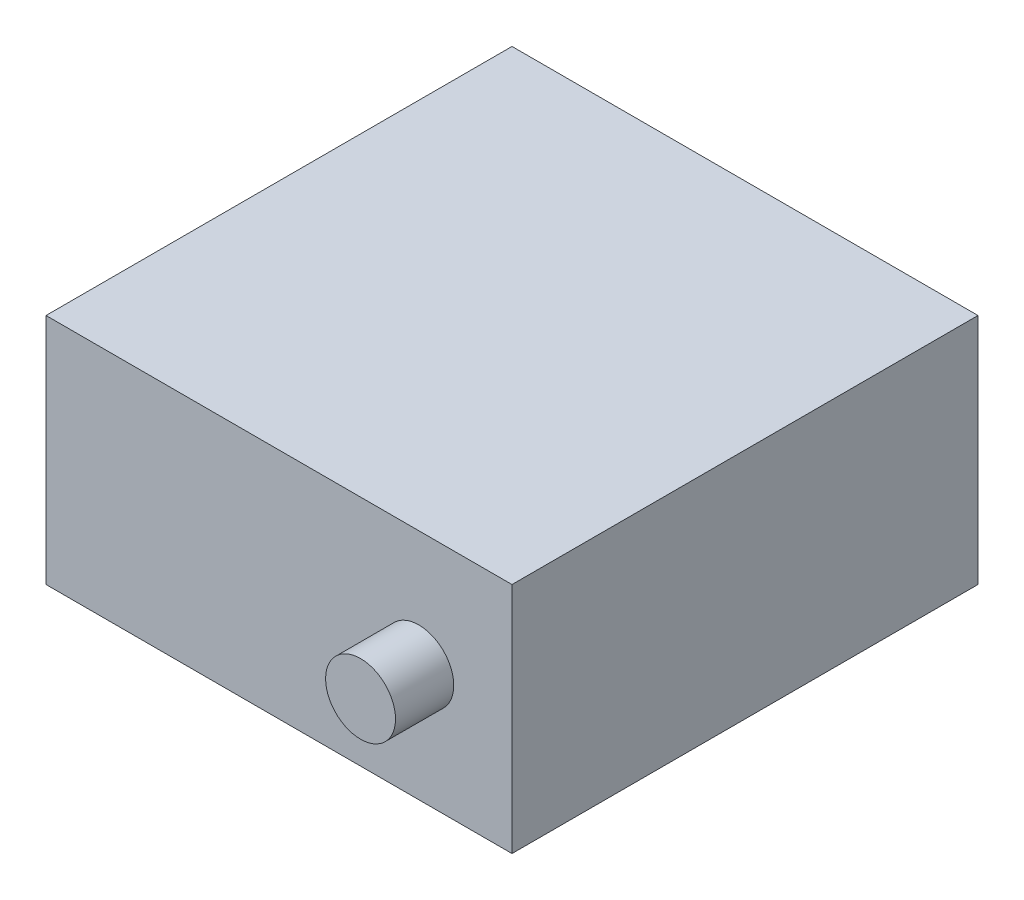
ISO-10303-21;
HEADER;
FILE_DESCRIPTION(('STEP AP214'),'2;1');
FILE_NAME('part.step','',(''),(''),'','','');
FILE_SCHEMA(('AUTOMOTIVE_DESIGN { 1 0 10303 214 1 1 1 1 }'));
ENDSEC;
DATA;
#1=APPLICATION_CONTEXT('core data for automotive mechanical design processes');
#2=APPLICATION_PROTOCOL_DEFINITION('international standard','automotive_design',2000,#1);
#3=PRODUCT_CONTEXT('',#1,'mechanical');
#4=PRODUCT('Part','Part','',(#3));
#5=PRODUCT_RELATED_PRODUCT_CATEGORY('part','',(#4));
#6=PRODUCT_DEFINITION_FORMATION('','',#4);
#7=PRODUCT_DEFINITION_CONTEXT('part definition',#1,'design');
#8=PRODUCT_DEFINITION('design','',#6,#7);
#9=PRODUCT_DEFINITION_SHAPE('','',#8);
#10=(LENGTH_UNIT() NAMED_UNIT(*) SI_UNIT(.MILLI.,.METRE.));
#11=(NAMED_UNIT(*) PLANE_ANGLE_UNIT() SI_UNIT($,.RADIAN.));
#12=(NAMED_UNIT(*) SI_UNIT($,.STERADIAN.) SOLID_ANGLE_UNIT());
#13=UNCERTAINTY_MEASURE_WITH_UNIT(LENGTH_MEASURE(1.E-05),#10,'distance_accuracy_value','');
#14=(GEOMETRIC_REPRESENTATION_CONTEXT(3) GLOBAL_UNCERTAINTY_ASSIGNED_CONTEXT((#13)) GLOBAL_UNIT_ASSIGNED_CONTEXT((#10,
#11,#12)) REPRESENTATION_CONTEXT('',''));
#15=CARTESIAN_POINT('',(0.,0.,0.));
#16=DIRECTION('',(0.,0.,1.));
#17=DIRECTION('',(1.,0.,0.));
#18=AXIS2_PLACEMENT_3D('',#15,#16,#17);
#19=CARTESIAN_POINT('',(-20.,20.,20.));
#20=DIRECTION('',(1.,0.,0.));
#21=DIRECTION('',(0.,0.,-1.));
#22=AXIS2_PLACEMENT_3D('',#19,#20,#21);
#23=PLANE('',#22);
#24=DIRECTION('',(0.,0.,1.));
#25=VECTOR('',#24,1.);
#26=CARTESIAN_POINT('',(-20.,0.,20.));
#27=LINE('',#26,#25);
#28=CARTESIAN_POINT('',(-20.,0.,-20.));
#29=VERTEX_POINT('',#28);
#30=CARTESIAN_POINT('',(-20.,0.,20.));
#31=VERTEX_POINT('',#30);
#32=EDGE_CURVE('E114',#29,#31,#27,.T.);
#33=ORIENTED_EDGE('',*,*,#32,.T.);
#34=DIRECTION('',(0.,-1.,0.));
#35=VECTOR('',#34,1.);
#36=CARTESIAN_POINT('',(-20.,20.,20.));
#37=LINE('',#36,#35);
#38=CARTESIAN_POINT('',(-20.,20.,20.));
#39=VERTEX_POINT('',#38);
#40=EDGE_CURVE('E52',#39,#31,#37,.T.);
#41=ORIENTED_EDGE('',*,*,#40,.F.);
#42=DIRECTION('',(0.,0.,1.));
#43=VECTOR('',#42,1.);
#44=CARTESIAN_POINT('',(-20.,20.,20.));
#45=LINE('',#44,#43);
#46=CARTESIAN_POINT('',(-20.,20.,-20.));
#47=VERTEX_POINT('',#46);
#48=EDGE_CURVE('E96',#47,#39,#45,.T.);
#49=ORIENTED_EDGE('',*,*,#48,.F.);
#50=DIRECTION('',(0.,-1.,0.));
#51=VECTOR('',#50,1.);
#52=CARTESIAN_POINT('',(-20.,20.,-20.));
#53=LINE('',#52,#51);
#54=EDGE_CURVE('E110',#47,#29,#53,.T.);
#55=ORIENTED_EDGE('',*,*,#54,.T.);
#56=EDGE_LOOP('',(#33,#41,#49,#55));
#57=FACE_BOUND('',#56,.T.);
#58=ADVANCED_FACE('F43',(#57),#23,.F.);
#59=CARTESIAN_POINT('',(20.,20.,20.));
#60=DIRECTION('',(0.,0.,-1.));
#61=DIRECTION('',(-1.,0.,0.));
#62=AXIS2_PLACEMENT_3D('',#59,#60,#61);
#63=PLANE('',#62);
#64=CARTESIAN_POINT('',(12.,10.,20.));
#65=DIRECTION('',(0.,0.,-1.));
#66=DIRECTION('',(-1.,0.,0.));
#67=AXIS2_PLACEMENT_3D('',#64,#65,#66);
#68=CIRCLE('',#67,3.);
#69=CARTESIAN_POINT('',(9.,10.,20.));
#70=VERTEX_POINT('',#69);
#71=EDGE_CURVE('E11',#70,#70,#68,.F.);
#72=ORIENTED_EDGE('',*,*,#71,.F.);
#73=EDGE_LOOP('',(#72));
#74=FACE_BOUND('',#73,.T.);
#75=DIRECTION('',(1.,0.,0.));
#76=VECTOR('',#75,1.);
#77=CARTESIAN_POINT('',(20.,0.,20.));
#78=LINE('',#77,#76);
#79=CARTESIAN_POINT('',(20.,0.,20.));
#80=VERTEX_POINT('',#79);
#81=EDGE_CURVE('E102',#31,#80,#78,.T.);
#82=ORIENTED_EDGE('',*,*,#81,.T.);
#83=DIRECTION('',(0.,-1.,0.));
#84=VECTOR('',#83,1.);
#85=CARTESIAN_POINT('',(20.,20.,20.));
#86=LINE('',#85,#84);
#87=CARTESIAN_POINT('',(20.,20.,20.));
#88=VERTEX_POINT('',#87);
#89=EDGE_CURVE('E100',#88,#80,#86,.T.);
#90=ORIENTED_EDGE('',*,*,#89,.F.);
#91=DIRECTION('',(1.,0.,0.));
#92=VECTOR('',#91,1.);
#93=CARTESIAN_POINT('',(20.,20.,20.));
#94=LINE('',#93,#92);
#95=EDGE_CURVE('E91',#39,#88,#94,.T.);
#96=ORIENTED_EDGE('',*,*,#95,.F.);
#97=ORIENTED_EDGE('',*,*,#40,.T.);
#98=EDGE_LOOP('',(#82,#90,#96,#97));
#99=FACE_BOUND('',#98,.T.);
#100=ADVANCED_FACE('F101',(#74,#99),#63,.F.);
#101=CARTESIAN_POINT('',(20.,20.,20.));
#102=DIRECTION('',(-1.,0.,0.));
#103=DIRECTION('',(0.,0.,1.));
#104=AXIS2_PLACEMENT_3D('',#101,#102,#103);
#105=PLANE('',#104);
#106=DIRECTION('',(0.,0.,-1.));
#107=VECTOR('',#106,1.);
#108=CARTESIAN_POINT('',(20.,0.,20.));
#109=LINE('',#108,#107);
#110=CARTESIAN_POINT('',(20.,0.,-20.));
#111=VERTEX_POINT('',#110);
#112=EDGE_CURVE('E77',#80,#111,#109,.T.);
#113=ORIENTED_EDGE('',*,*,#112,.T.);
#114=DIRECTION('',(0.,-1.,0.));
#115=VECTOR('',#114,1.);
#116=CARTESIAN_POINT('',(20.,20.,-20.));
#117=LINE('',#116,#115);
#118=CARTESIAN_POINT('',(20.,20.,-20.));
#119=VERTEX_POINT('',#118);
#120=EDGE_CURVE('E104',#119,#111,#117,.T.);
#121=ORIENTED_EDGE('',*,*,#120,.F.);
#122=DIRECTION('',(0.,0.,-1.));
#123=VECTOR('',#122,1.);
#124=CARTESIAN_POINT('',(20.,20.,20.));
#125=LINE('',#124,#123);
#126=EDGE_CURVE('E94',#88,#119,#125,.T.);
#127=ORIENTED_EDGE('',*,*,#126,.F.);
#128=ORIENTED_EDGE('',*,*,#89,.T.);
#129=EDGE_LOOP('',(#113,#121,#127,#128));
#130=FACE_BOUND('',#129,.T.);
#131=ADVANCED_FACE('F106',(#130),#105,.F.);
#132=CARTESIAN_POINT('',(20.,20.,-20.));
#133=DIRECTION('',(0.,0.,1.));
#134=DIRECTION('',(1.,0.,0.));
#135=AXIS2_PLACEMENT_3D('',#132,#133,#134);
#136=PLANE('',#135);
#137=DIRECTION('',(-1.,0.,0.));
#138=VECTOR('',#137,1.);
#139=CARTESIAN_POINT('',(20.,0.,-20.));
#140=LINE('',#139,#138);
#141=EDGE_CURVE('E83',#111,#29,#140,.T.);
#142=ORIENTED_EDGE('',*,*,#141,.T.);
#143=ORIENTED_EDGE('',*,*,#54,.F.);
#144=DIRECTION('',(-1.,0.,0.));
#145=VECTOR('',#144,1.);
#146=CARTESIAN_POINT('',(20.,20.,-20.));
#147=LINE('',#146,#145);
#148=EDGE_CURVE('E60',#119,#47,#147,.T.);
#149=ORIENTED_EDGE('',*,*,#148,.F.);
#150=ORIENTED_EDGE('',*,*,#120,.T.);
#151=EDGE_LOOP('',(#142,#143,#149,#150));
#152=FACE_BOUND('',#151,.T.);
#153=ADVANCED_FACE('F143',(#152),#136,.F.);
#154=CARTESIAN_POINT('',(0.,20.,0.));
#155=DIRECTION('',(0.,1.,0.));
#156=DIRECTION('',(0.,0.,1.));
#157=AXIS2_PLACEMENT_3D('',#154,#155,#156);
#158=PLANE('',#157);
#159=ORIENTED_EDGE('',*,*,#48,.T.);
#160=ORIENTED_EDGE('',*,*,#95,.T.);
#161=ORIENTED_EDGE('',*,*,#126,.T.);
#162=ORIENTED_EDGE('',*,*,#148,.T.);
#163=EDGE_LOOP('',(#159,#160,#161,#162));
#164=FACE_BOUND('',#163,.T.);
#165=ADVANCED_FACE('F92',(#164),#158,.T.);
#166=CARTESIAN_POINT('',(0.,0.,0.));
#167=DIRECTION('',(0.,1.,0.));
#168=DIRECTION('',(0.,0.,1.));
#169=AXIS2_PLACEMENT_3D('',#166,#167,#168);
#170=PLANE('',#169);
#171=ORIENTED_EDGE('',*,*,#32,.F.);
#172=ORIENTED_EDGE('',*,*,#141,.F.);
#173=ORIENTED_EDGE('',*,*,#112,.F.);
#174=ORIENTED_EDGE('',*,*,#81,.F.);
#175=EDGE_LOOP('',(#171,#172,#173,#174));
#176=FACE_BOUND('',#175,.T.);
#177=ADVANCED_FACE('F132',(#176),#170,.F.);
#178=CARTESIAN_POINT('',(12.,10.,25.));
#179=DIRECTION('',(0.,0.,-1.));
#180=DIRECTION('',(-1.,0.,0.));
#181=AXIS2_PLACEMENT_3D('',#178,#179,#180);
#182=CYLINDRICAL_SURFACE('',#181,3.);
#183=CARTESIAN_POINT('',(12.,10.,25.));
#184=DIRECTION('',(0.,0.,1.));
#185=DIRECTION('',(1.,0.,0.));
#186=AXIS2_PLACEMENT_3D('',#183,#184,#185);
#187=CIRCLE('',#186,3.);
#188=CARTESIAN_POINT('',(15.,10.,25.));
#189=VERTEX_POINT('',#188);
#190=EDGE_CURVE('E118',#189,#189,#187,.T.);
#191=ORIENTED_EDGE('',*,*,#190,.F.);
#192=EDGE_LOOP('',(#191));
#193=FACE_BOUND('',#192,.T.);
#194=ORIENTED_EDGE('',*,*,#71,.T.);
#195=EDGE_LOOP('',(#194));
#196=FACE_BOUND('',#195,.T.);
#197=ADVANCED_FACE('F134',(#193,#196),#182,.T.);
#198=CARTESIAN_POINT('',(12.,10.,25.));
#199=DIRECTION('',(0.,0.,1.));
#200=DIRECTION('',(1.,0.,0.));
#201=AXIS2_PLACEMENT_3D('',#198,#199,#200);
#202=PLANE('',#201);
#203=ORIENTED_EDGE('',*,*,#190,.T.);
#204=EDGE_LOOP('',(#203));
#205=FACE_BOUND('',#204,.T.);
#206=ADVANCED_FACE('F140',(#205),#202,.T.);
#207=CLOSED_SHELL('',(#58,#100,#131,#153,#165,#177,#197,#206));
#208=MANIFOLD_SOLID_BREP('B2',#207);
#209=ADVANCED_BREP_SHAPE_REPRESENTATION('',(#18,#208),#14);
#210=SHAPE_DEFINITION_REPRESENTATION(#9,#209);
ENDSEC;
END-ISO-10303-21;
